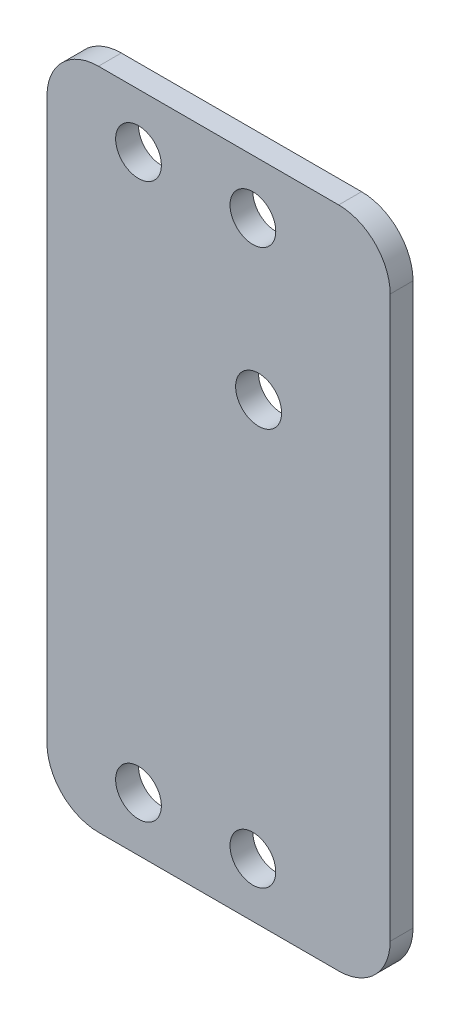
ISO-10303-21;
HEADER;
FILE_DESCRIPTION(('STEP AP214'),'2;1');
FILE_NAME('part.step','',(''),(''),'','','');
FILE_SCHEMA(('AUTOMOTIVE_DESIGN { 1 0 10303 214 1 1 1 1 }'));
ENDSEC;
DATA;
#1=APPLICATION_CONTEXT('core data for automotive mechanical design processes');
#2=APPLICATION_PROTOCOL_DEFINITION('international standard','automotive_design',2000,#1);
#3=PRODUCT_CONTEXT('',#1,'mechanical');
#4=PRODUCT('Part','Part','',(#3));
#5=PRODUCT_RELATED_PRODUCT_CATEGORY('part','',(#4));
#6=PRODUCT_DEFINITION_FORMATION('','',#4);
#7=PRODUCT_DEFINITION_CONTEXT('part definition',#1,'design');
#8=PRODUCT_DEFINITION('design','',#6,#7);
#9=PRODUCT_DEFINITION_SHAPE('','',#8);
#10=(LENGTH_UNIT() NAMED_UNIT(*) SI_UNIT(.MILLI.,.METRE.));
#11=(NAMED_UNIT(*) PLANE_ANGLE_UNIT() SI_UNIT($,.RADIAN.));
#12=(NAMED_UNIT(*) SI_UNIT($,.STERADIAN.) SOLID_ANGLE_UNIT());
#13=UNCERTAINTY_MEASURE_WITH_UNIT(LENGTH_MEASURE(1.E-05),#10,'distance_accuracy_value','');
#14=(GEOMETRIC_REPRESENTATION_CONTEXT(3) GLOBAL_UNCERTAINTY_ASSIGNED_CONTEXT((#13)) GLOBAL_UNIT_ASSIGNED_CONTEXT((#10,
#11,#12)) REPRESENTATION_CONTEXT('',''));
#15=CARTESIAN_POINT('',(0.,0.,0.));
#16=DIRECTION('',(0.,0.,1.));
#17=DIRECTION('',(1.,0.,0.));
#18=AXIS2_PLACEMENT_3D('',#15,#16,#17);
#19=CARTESIAN_POINT('',(0.,0.,2.));
#20=DIRECTION('',(0.,0.,1.));
#21=DIRECTION('',(1.,0.,0.));
#22=AXIS2_PLACEMENT_3D('',#19,#20,#21);
#23=PLANE('',#22);
#24=CARTESIAN_POINT('',(3.,-24.25,2.));
#25=DIRECTION('',(0.,0.,1.));
#26=DIRECTION('',(1.,0.,0.));
#27=AXIS2_PLACEMENT_3D('',#24,#25,#26);
#28=CIRCLE('',#27,2.);
#29=CARTESIAN_POINT('',(5.,-24.25,2.));
#30=VERTEX_POINT('',#29);
#31=EDGE_CURVE('E194',#30,#30,#28,.T.);
#32=ORIENTED_EDGE('',*,*,#31,.F.);
#33=EDGE_LOOP('',(#32));
#34=FACE_BOUND('',#33,.T.);
#35=CARTESIAN_POINT('',(-7.00000000000001,24.25,2.));
#36=DIRECTION('',(0.,0.,1.));
#37=DIRECTION('',(1.,0.,0.));
#38=AXIS2_PLACEMENT_3D('',#35,#36,#37);
#39=CIRCLE('',#38,2.);
#40=CARTESIAN_POINT('',(-5.00000000000001,24.25,2.));
#41=VERTEX_POINT('',#40);
#42=EDGE_CURVE('E183',#41,#41,#39,.T.);
#43=ORIENTED_EDGE('',*,*,#42,.F.);
#44=EDGE_LOOP('',(#43));
#45=FACE_BOUND('',#44,.T.);
#46=DIRECTION('',(1.,0.,0.));
#47=VECTOR('',#46,1.);
#48=CARTESIAN_POINT('',(-15.,-29.,2.));
#49=LINE('',#48,#47);
#50=CARTESIAN_POINT('',(-10.5,-29.,2.));
#51=VERTEX_POINT('',#50);
#52=CARTESIAN_POINT('',(10.5,-29.,2.));
#53=VERTEX_POINT('',#52);
#54=EDGE_CURVE('E168',#51,#53,#49,.T.);
#55=ORIENTED_EDGE('',*,*,#54,.T.);
#56=CARTESIAN_POINT('',(10.5,-24.5,2.));
#57=DIRECTION('',(0.,0.,1.));
#58=DIRECTION('',(1.,0.,0.));
#59=AXIS2_PLACEMENT_3D('',#56,#57,#58);
#60=CIRCLE('',#59,4.5);
#61=CARTESIAN_POINT('',(15.,-24.5,2.));
#62=VERTEX_POINT('',#61);
#63=EDGE_CURVE('E148',#53,#62,#60,.T.);
#64=ORIENTED_EDGE('',*,*,#63,.T.);
#65=DIRECTION('',(0.,1.,0.));
#66=VECTOR('',#65,1.);
#67=CARTESIAN_POINT('',(15.,29.,2.));
#68=LINE('',#67,#66);
#69=CARTESIAN_POINT('',(15.,24.5,2.));
#70=VERTEX_POINT('',#69);
#71=EDGE_CURVE('E118',#62,#70,#68,.T.);
#72=ORIENTED_EDGE('',*,*,#71,.T.);
#73=CARTESIAN_POINT('',(10.5,24.5,2.));
#74=DIRECTION('',(0.,0.,1.));
#75=DIRECTION('',(1.,0.,0.));
#76=AXIS2_PLACEMENT_3D('',#73,#74,#75);
#77=CIRCLE('',#76,4.5);
#78=CARTESIAN_POINT('',(10.5,29.,2.));
#79=VERTEX_POINT('',#78);
#80=EDGE_CURVE('E54',#70,#79,#77,.T.);
#81=ORIENTED_EDGE('',*,*,#80,.T.);
#82=DIRECTION('',(-1.,0.,0.));
#83=VECTOR('',#82,1.);
#84=CARTESIAN_POINT('',(-15.,29.,2.));
#85=LINE('',#84,#83);
#86=CARTESIAN_POINT('',(-10.5,29.,2.));
#87=VERTEX_POINT('',#86);
#88=EDGE_CURVE('E135',#79,#87,#85,.T.);
#89=ORIENTED_EDGE('',*,*,#88,.T.);
#90=CARTESIAN_POINT('',(-10.5,24.5,2.));
#91=DIRECTION('',(0.,0.,1.));
#92=DIRECTION('',(1.,0.,0.));
#93=AXIS2_PLACEMENT_3D('',#90,#91,#92);
#94=CIRCLE('',#93,4.5);
#95=CARTESIAN_POINT('',(-15.,24.5,2.));
#96=VERTEX_POINT('',#95);
#97=EDGE_CURVE('E143',#87,#96,#94,.T.);
#98=ORIENTED_EDGE('',*,*,#97,.T.);
#99=DIRECTION('',(0.,-1.,0.));
#100=VECTOR('',#99,1.);
#101=CARTESIAN_POINT('',(-15.,29.,2.));
#102=LINE('',#101,#100);
#103=CARTESIAN_POINT('',(-15.,-24.5,2.));
#104=VERTEX_POINT('',#103);
#105=EDGE_CURVE('E129',#96,#104,#102,.T.);
#106=ORIENTED_EDGE('',*,*,#105,.T.);
#107=CARTESIAN_POINT('',(-10.5,-24.5,2.));
#108=DIRECTION('',(0.,0.,1.));
#109=DIRECTION('',(1.,0.,0.));
#110=AXIS2_PLACEMENT_3D('',#107,#108,#109);
#111=CIRCLE('',#110,4.5);
#112=EDGE_CURVE('E146',#104,#51,#111,.T.);
#113=ORIENTED_EDGE('',*,*,#112,.T.);
#114=EDGE_LOOP('',(#55,#64,#72,#81,#89,#98,#106,#113));
#115=FACE_BOUND('',#114,.T.);
#116=CARTESIAN_POINT('',(2.99999999999999,24.25,2.));
#117=DIRECTION('',(0.,0.,1.));
#118=DIRECTION('',(1.,0.,0.));
#119=AXIS2_PLACEMENT_3D('',#116,#117,#118);
#120=CIRCLE('',#119,2.);
#121=CARTESIAN_POINT('',(4.99999999999999,24.25,2.));
#122=VERTEX_POINT('',#121);
#123=EDGE_CURVE('E174',#122,#122,#120,.T.);
#124=ORIENTED_EDGE('',*,*,#123,.F.);
#125=EDGE_LOOP('',(#124));
#126=FACE_BOUND('',#125,.T.);
#127=CARTESIAN_POINT('',(-7.,-24.25,2.));
#128=DIRECTION('',(0.,0.,1.));
#129=DIRECTION('',(1.,0.,0.));
#130=AXIS2_PLACEMENT_3D('',#127,#128,#129);
#131=CIRCLE('',#130,2.);
#132=CARTESIAN_POINT('',(-5.,-24.25,2.));
#133=VERTEX_POINT('',#132);
#134=EDGE_CURVE('E188',#133,#133,#131,.T.);
#135=ORIENTED_EDGE('',*,*,#134,.F.);
#136=EDGE_LOOP('',(#135));
#137=FACE_BOUND('',#136,.T.);
#138=CARTESIAN_POINT('',(3.5,10.75,2.));
#139=DIRECTION('',(0.,0.,1.));
#140=DIRECTION('',(1.,0.,0.));
#141=AXIS2_PLACEMENT_3D('',#138,#139,#140);
#142=CIRCLE('',#141,2.01);
#143=CARTESIAN_POINT('',(5.51,10.75,2.));
#144=VERTEX_POINT('',#143);
#145=EDGE_CURVE('E200',#144,#144,#142,.T.);
#146=ORIENTED_EDGE('',*,*,#145,.F.);
#147=EDGE_LOOP('',(#146));
#148=FACE_BOUND('',#147,.T.);
#149=ADVANCED_FACE('F33',(#34,#45,#115,#126,#137,#148),#23,.T.);
#150=CARTESIAN_POINT('',(0.,0.,0.));
#151=DIRECTION('',(0.,0.,1.));
#152=DIRECTION('',(1.,0.,0.));
#153=AXIS2_PLACEMENT_3D('',#150,#151,#152);
#154=PLANE('',#153);
#155=DIRECTION('',(0.,1.,0.));
#156=VECTOR('',#155,1.);
#157=CARTESIAN_POINT('',(15.,29.,0.));
#158=LINE('',#157,#156);
#159=CARTESIAN_POINT('',(15.,-24.5,0.));
#160=VERTEX_POINT('',#159);
#161=CARTESIAN_POINT('',(15.,24.5,0.));
#162=VERTEX_POINT('',#161);
#163=EDGE_CURVE('E116',#160,#162,#158,.T.);
#164=ORIENTED_EDGE('',*,*,#163,.F.);
#165=CARTESIAN_POINT('',(10.5,-24.5,0.));
#166=DIRECTION('',(0.,0.,1.));
#167=DIRECTION('',(1.,0.,0.));
#168=AXIS2_PLACEMENT_3D('',#165,#166,#167);
#169=CIRCLE('',#168,4.5);
#170=CARTESIAN_POINT('',(10.5,-29.,0.));
#171=VERTEX_POINT('',#170);
#172=EDGE_CURVE('E99',#160,#171,#169,.F.);
#173=ORIENTED_EDGE('',*,*,#172,.T.);
#174=DIRECTION('',(1.,0.,0.));
#175=VECTOR('',#174,1.);
#176=CARTESIAN_POINT('',(-15.,-29.,0.));
#177=LINE('',#176,#175);
#178=CARTESIAN_POINT('',(-10.5,-29.,0.));
#179=VERTEX_POINT('',#178);
#180=EDGE_CURVE('E127',#179,#171,#177,.T.);
#181=ORIENTED_EDGE('',*,*,#180,.F.);
#182=CARTESIAN_POINT('',(-10.5,-24.5,0.));
#183=DIRECTION('',(0.,0.,1.));
#184=DIRECTION('',(1.,0.,0.));
#185=AXIS2_PLACEMENT_3D('',#182,#183,#184);
#186=CIRCLE('',#185,4.5);
#187=CARTESIAN_POINT('',(-15.,-24.5,0.));
#188=VERTEX_POINT('',#187);
#189=EDGE_CURVE('E110',#179,#188,#186,.F.);
#190=ORIENTED_EDGE('',*,*,#189,.T.);
#191=DIRECTION('',(0.,-1.,0.));
#192=VECTOR('',#191,1.);
#193=CARTESIAN_POINT('',(-15.,29.,0.));
#194=LINE('',#193,#192);
#195=CARTESIAN_POINT('',(-15.,24.5,0.));
#196=VERTEX_POINT('',#195);
#197=EDGE_CURVE('E131',#196,#188,#194,.T.);
#198=ORIENTED_EDGE('',*,*,#197,.F.);
#199=CARTESIAN_POINT('',(-10.5,24.5,0.));
#200=DIRECTION('',(0.,0.,1.));
#201=DIRECTION('',(1.,0.,0.));
#202=AXIS2_PLACEMENT_3D('',#199,#200,#201);
#203=CIRCLE('',#202,4.5);
#204=CARTESIAN_POINT('',(-10.5,29.,0.));
#205=VERTEX_POINT('',#204);
#206=EDGE_CURVE('E119',#196,#205,#203,.F.);
#207=ORIENTED_EDGE('',*,*,#206,.T.);
#208=DIRECTION('',(-1.,0.,0.));
#209=VECTOR('',#208,1.);
#210=CARTESIAN_POINT('',(-15.,29.,0.));
#211=LINE('',#210,#209);
#212=CARTESIAN_POINT('',(10.5,29.,0.));
#213=VERTEX_POINT('',#212);
#214=EDGE_CURVE('E126',#213,#205,#211,.T.);
#215=ORIENTED_EDGE('',*,*,#214,.F.);
#216=CARTESIAN_POINT('',(10.5,24.5,0.));
#217=DIRECTION('',(0.,0.,1.));
#218=DIRECTION('',(1.,0.,0.));
#219=AXIS2_PLACEMENT_3D('',#216,#217,#218);
#220=CIRCLE('',#219,4.5);
#221=EDGE_CURVE('E125',#213,#162,#220,.F.);
#222=ORIENTED_EDGE('',*,*,#221,.T.);
#223=EDGE_LOOP('',(#164,#173,#181,#190,#198,#207,#215,#222));
#224=FACE_BOUND('',#223,.T.);
#225=CARTESIAN_POINT('',(2.99999999999999,24.25,0.));
#226=DIRECTION('',(0.,0.,1.));
#227=DIRECTION('',(1.,0.,0.));
#228=AXIS2_PLACEMENT_3D('',#225,#226,#227);
#229=CIRCLE('',#228,2.);
#230=CARTESIAN_POINT('',(4.99999999999999,24.25,0.));
#231=VERTEX_POINT('',#230);
#232=EDGE_CURVE('E176',#231,#231,#229,.T.);
#233=ORIENTED_EDGE('',*,*,#232,.T.);
#234=EDGE_LOOP('',(#233));
#235=FACE_BOUND('',#234,.T.);
#236=CARTESIAN_POINT('',(-7.00000000000001,24.25,0.));
#237=DIRECTION('',(0.,0.,1.));
#238=DIRECTION('',(1.,0.,0.));
#239=AXIS2_PLACEMENT_3D('',#236,#237,#238);
#240=CIRCLE('',#239,2.);
#241=CARTESIAN_POINT('',(-5.00000000000001,24.25,0.));
#242=VERTEX_POINT('',#241);
#243=EDGE_CURVE('E185',#242,#242,#240,.T.);
#244=ORIENTED_EDGE('',*,*,#243,.T.);
#245=EDGE_LOOP('',(#244));
#246=FACE_BOUND('',#245,.T.);
#247=CARTESIAN_POINT('',(-7.,-24.25,0.));
#248=DIRECTION('',(0.,0.,1.));
#249=DIRECTION('',(1.,0.,0.));
#250=AXIS2_PLACEMENT_3D('',#247,#248,#249);
#251=CIRCLE('',#250,2.);
#252=CARTESIAN_POINT('',(-5.,-24.25,0.));
#253=VERTEX_POINT('',#252);
#254=EDGE_CURVE('E191',#253,#253,#251,.T.);
#255=ORIENTED_EDGE('',*,*,#254,.T.);
#256=EDGE_LOOP('',(#255));
#257=FACE_BOUND('',#256,.T.);
#258=CARTESIAN_POINT('',(3.,-24.25,0.));
#259=DIRECTION('',(0.,0.,1.));
#260=DIRECTION('',(1.,0.,0.));
#261=AXIS2_PLACEMENT_3D('',#258,#259,#260);
#262=CIRCLE('',#261,2.);
#263=CARTESIAN_POINT('',(5.,-24.25,0.));
#264=VERTEX_POINT('',#263);
#265=EDGE_CURVE('E197',#264,#264,#262,.T.);
#266=ORIENTED_EDGE('',*,*,#265,.T.);
#267=EDGE_LOOP('',(#266));
#268=FACE_BOUND('',#267,.T.);
#269=CARTESIAN_POINT('',(3.5,10.75,0.));
#270=DIRECTION('',(0.,0.,1.));
#271=DIRECTION('',(1.,0.,0.));
#272=AXIS2_PLACEMENT_3D('',#269,#270,#271);
#273=CIRCLE('',#272,2.01);
#274=CARTESIAN_POINT('',(5.51,10.75,0.));
#275=VERTEX_POINT('',#274);
#276=EDGE_CURVE('E203',#275,#275,#273,.T.);
#277=ORIENTED_EDGE('',*,*,#276,.T.);
#278=EDGE_LOOP('',(#277));
#279=FACE_BOUND('',#278,.T.);
#280=ADVANCED_FACE('F122',(#224,#235,#246,#257,#268,#279),#154,.F.);
#281=CARTESIAN_POINT('',(-15.,29.,2.));
#282=DIRECTION('',(1.,0.,0.));
#283=DIRECTION('',(0.,0.,-1.));
#284=AXIS2_PLACEMENT_3D('',#281,#282,#283);
#285=PLANE('',#284);
#286=ORIENTED_EDGE('',*,*,#197,.T.);
#287=DIRECTION('',(0.,0.,-1.));
#288=VECTOR('',#287,1.);
#289=CARTESIAN_POINT('',(-15.,-24.5,2.));
#290=LINE('',#289,#288);
#291=EDGE_CURVE('E153',#188,#104,#290,.F.);
#292=ORIENTED_EDGE('',*,*,#291,.T.);
#293=ORIENTED_EDGE('',*,*,#105,.F.);
#294=DIRECTION('',(0.,0.,-1.));
#295=VECTOR('',#294,1.);
#296=CARTESIAN_POINT('',(-15.,24.5,2.));
#297=LINE('',#296,#295);
#298=EDGE_CURVE('E150',#96,#196,#297,.T.);
#299=ORIENTED_EDGE('',*,*,#298,.T.);
#300=EDGE_LOOP('',(#286,#292,#293,#299));
#301=FACE_BOUND('',#300,.T.);
#302=ADVANCED_FACE('F159',(#301),#285,.F.);
#303=CARTESIAN_POINT('',(-15.,-29.,2.));
#304=DIRECTION('',(0.,1.,0.));
#305=DIRECTION('',(0.,0.,1.));
#306=AXIS2_PLACEMENT_3D('',#303,#304,#305);
#307=PLANE('',#306);
#308=ORIENTED_EDGE('',*,*,#180,.T.);
#309=DIRECTION('',(0.,0.,-1.));
#310=VECTOR('',#309,1.);
#311=CARTESIAN_POINT('',(10.5,-29.,2.));
#312=LINE('',#311,#310);
#313=EDGE_CURVE('E104',#171,#53,#312,.F.);
#314=ORIENTED_EDGE('',*,*,#313,.T.);
#315=ORIENTED_EDGE('',*,*,#54,.F.);
#316=DIRECTION('',(0.,0.,-1.));
#317=VECTOR('',#316,1.);
#318=CARTESIAN_POINT('',(-10.5,-29.,2.));
#319=LINE('',#318,#317);
#320=EDGE_CURVE('E109',#51,#179,#319,.T.);
#321=ORIENTED_EDGE('',*,*,#320,.T.);
#322=EDGE_LOOP('',(#308,#314,#315,#321));
#323=FACE_BOUND('',#322,.T.);
#324=ADVANCED_FACE('F173',(#323),#307,.F.);
#325=CARTESIAN_POINT('',(15.,29.,2.));
#326=DIRECTION('',(-1.,0.,0.));
#327=DIRECTION('',(0.,0.,1.));
#328=AXIS2_PLACEMENT_3D('',#325,#326,#327);
#329=PLANE('',#328);
#330=ORIENTED_EDGE('',*,*,#71,.F.);
#331=DIRECTION('',(0.,0.,-1.));
#332=VECTOR('',#331,1.);
#333=CARTESIAN_POINT('',(15.,-24.5,2.));
#334=LINE('',#333,#332);
#335=EDGE_CURVE('E103',#62,#160,#334,.T.);
#336=ORIENTED_EDGE('',*,*,#335,.T.);
#337=ORIENTED_EDGE('',*,*,#163,.T.);
#338=DIRECTION('',(0.,0.,-1.));
#339=VECTOR('',#338,1.);
#340=CARTESIAN_POINT('',(15.,24.5,2.));
#341=LINE('',#340,#339);
#342=EDGE_CURVE('E120',#162,#70,#341,.F.);
#343=ORIENTED_EDGE('',*,*,#342,.T.);
#344=EDGE_LOOP('',(#330,#336,#337,#343));
#345=FACE_BOUND('',#344,.T.);
#346=ADVANCED_FACE('F115',(#345),#329,.F.);
#347=CARTESIAN_POINT('',(-15.,29.,2.));
#348=DIRECTION('',(0.,-1.,0.));
#349=DIRECTION('',(0.,0.,-1.));
#350=AXIS2_PLACEMENT_3D('',#347,#348,#349);
#351=PLANE('',#350);
#352=ORIENTED_EDGE('',*,*,#88,.F.);
#353=DIRECTION('',(0.,0.,-1.));
#354=VECTOR('',#353,1.);
#355=CARTESIAN_POINT('',(10.5,29.,2.));
#356=LINE('',#355,#354);
#357=EDGE_CURVE('E11',#79,#213,#356,.T.);
#358=ORIENTED_EDGE('',*,*,#357,.T.);
#359=ORIENTED_EDGE('',*,*,#214,.T.);
#360=DIRECTION('',(0.,0.,-1.));
#361=VECTOR('',#360,1.);
#362=CARTESIAN_POINT('',(-10.5,29.,2.));
#363=LINE('',#362,#361);
#364=EDGE_CURVE('E41',#205,#87,#363,.F.);
#365=ORIENTED_EDGE('',*,*,#364,.T.);
#366=EDGE_LOOP('',(#352,#358,#359,#365));
#367=FACE_BOUND('',#366,.T.);
#368=ADVANCED_FACE('F225',(#367),#351,.F.);
#369=CARTESIAN_POINT('',(2.99999999999999,24.25,2.));
#370=DIRECTION('',(0.,0.,-1.));
#371=DIRECTION('',(-1.,0.,0.));
#372=AXIS2_PLACEMENT_3D('',#369,#370,#371);
#373=CYLINDRICAL_SURFACE('',#372,2.);
#374=ORIENTED_EDGE('',*,*,#123,.T.);
#375=EDGE_LOOP('',(#374));
#376=FACE_BOUND('',#375,.T.);
#377=ORIENTED_EDGE('',*,*,#232,.F.);
#378=EDGE_LOOP('',(#377));
#379=FACE_BOUND('',#378,.T.);
#380=ADVANCED_FACE('F222',(#376,#379),#373,.F.);
#381=CARTESIAN_POINT('',(-7.00000000000001,24.25,2.));
#382=DIRECTION('',(0.,0.,-1.));
#383=DIRECTION('',(-1.,0.,0.));
#384=AXIS2_PLACEMENT_3D('',#381,#382,#383);
#385=CYLINDRICAL_SURFACE('',#384,2.);
#386=ORIENTED_EDGE('',*,*,#42,.T.);
#387=EDGE_LOOP('',(#386));
#388=FACE_BOUND('',#387,.T.);
#389=ORIENTED_EDGE('',*,*,#243,.F.);
#390=EDGE_LOOP('',(#389));
#391=FACE_BOUND('',#390,.T.);
#392=ADVANCED_FACE('F327',(#388,#391),#385,.F.);
#393=CARTESIAN_POINT('',(-7.,-24.25,2.));
#394=DIRECTION('',(0.,0.,-1.));
#395=DIRECTION('',(-1.,0.,0.));
#396=AXIS2_PLACEMENT_3D('',#393,#394,#395);
#397=CYLINDRICAL_SURFACE('',#396,2.);
#398=ORIENTED_EDGE('',*,*,#134,.T.);
#399=EDGE_LOOP('',(#398));
#400=FACE_BOUND('',#399,.T.);
#401=ORIENTED_EDGE('',*,*,#254,.F.);
#402=EDGE_LOOP('',(#401));
#403=FACE_BOUND('',#402,.T.);
#404=ADVANCED_FACE('F317',(#400,#403),#397,.F.);
#405=CARTESIAN_POINT('',(3.,-24.25,2.));
#406=DIRECTION('',(0.,0.,-1.));
#407=DIRECTION('',(-1.,0.,0.));
#408=AXIS2_PLACEMENT_3D('',#405,#406,#407);
#409=CYLINDRICAL_SURFACE('',#408,2.);
#410=ORIENTED_EDGE('',*,*,#31,.T.);
#411=EDGE_LOOP('',(#410));
#412=FACE_BOUND('',#411,.T.);
#413=ORIENTED_EDGE('',*,*,#265,.F.);
#414=EDGE_LOOP('',(#413));
#415=FACE_BOUND('',#414,.T.);
#416=ADVANCED_FACE('F308',(#412,#415),#409,.F.);
#417=CARTESIAN_POINT('',(3.5,10.75,2.));
#418=DIRECTION('',(0.,0.,-1.));
#419=DIRECTION('',(-1.,0.,0.));
#420=AXIS2_PLACEMENT_3D('',#417,#418,#419);
#421=CYLINDRICAL_SURFACE('',#420,2.01);
#422=ORIENTED_EDGE('',*,*,#145,.T.);
#423=EDGE_LOOP('',(#422));
#424=FACE_BOUND('',#423,.T.);
#425=ORIENTED_EDGE('',*,*,#276,.F.);
#426=EDGE_LOOP('',(#425));
#427=FACE_BOUND('',#426,.T.);
#428=ADVANCED_FACE('F209',(#424,#427),#421,.F.);
#429=CARTESIAN_POINT('',(10.5,-24.5,2.));
#430=DIRECTION('',(0.,0.,-1.));
#431=DIRECTION('',(-1.,0.,0.));
#432=AXIS2_PLACEMENT_3D('',#429,#430,#431);
#433=CYLINDRICAL_SURFACE('',#432,4.5);
#434=ORIENTED_EDGE('',*,*,#63,.F.);
#435=ORIENTED_EDGE('',*,*,#313,.F.);
#436=ORIENTED_EDGE('',*,*,#172,.F.);
#437=ORIENTED_EDGE('',*,*,#335,.F.);
#438=EDGE_LOOP('',(#434,#435,#436,#437));
#439=FACE_BOUND('',#438,.T.);
#440=ADVANCED_FACE('F102',(#439),#433,.T.);
#441=CARTESIAN_POINT('',(-10.5,-24.5,2.));
#442=DIRECTION('',(0.,0.,-1.));
#443=DIRECTION('',(-1.,0.,0.));
#444=AXIS2_PLACEMENT_3D('',#441,#442,#443);
#445=CYLINDRICAL_SURFACE('',#444,4.5);
#446=ORIENTED_EDGE('',*,*,#112,.F.);
#447=ORIENTED_EDGE('',*,*,#291,.F.);
#448=ORIENTED_EDGE('',*,*,#189,.F.);
#449=ORIENTED_EDGE('',*,*,#320,.F.);
#450=EDGE_LOOP('',(#446,#447,#448,#449));
#451=FACE_BOUND('',#450,.T.);
#452=ADVANCED_FACE('F171',(#451),#445,.T.);
#453=CARTESIAN_POINT('',(10.5,24.5,2.));
#454=DIRECTION('',(0.,0.,-1.));
#455=DIRECTION('',(-1.,0.,0.));
#456=AXIS2_PLACEMENT_3D('',#453,#454,#455);
#457=CYLINDRICAL_SURFACE('',#456,4.5);
#458=ORIENTED_EDGE('',*,*,#80,.F.);
#459=ORIENTED_EDGE('',*,*,#342,.F.);
#460=ORIENTED_EDGE('',*,*,#221,.F.);
#461=ORIENTED_EDGE('',*,*,#357,.F.);
#462=EDGE_LOOP('',(#458,#459,#460,#461));
#463=FACE_BOUND('',#462,.T.);
#464=ADVANCED_FACE('F237',(#463),#457,.T.);
#465=CARTESIAN_POINT('',(-10.5,24.5,2.));
#466=DIRECTION('',(0.,0.,-1.));
#467=DIRECTION('',(-1.,0.,0.));
#468=AXIS2_PLACEMENT_3D('',#465,#466,#467);
#469=CYLINDRICAL_SURFACE('',#468,4.5);
#470=ORIENTED_EDGE('',*,*,#97,.F.);
#471=ORIENTED_EDGE('',*,*,#364,.F.);
#472=ORIENTED_EDGE('',*,*,#206,.F.);
#473=ORIENTED_EDGE('',*,*,#298,.F.);
#474=EDGE_LOOP('',(#470,#471,#472,#473));
#475=FACE_BOUND('',#474,.T.);
#476=ADVANCED_FACE('F35',(#475),#469,.T.);
#477=CLOSED_SHELL('',(#149,#280,#302,#324,#346,#368,#380,#392,#404,#416,#428,#440,#452,#464,#476));
#478=MANIFOLD_SOLID_BREP('B2',#477);
#479=ADVANCED_BREP_SHAPE_REPRESENTATION('',(#18,#478),#14);
#480=SHAPE_DEFINITION_REPRESENTATION(#9,#479);
ENDSEC;
END-ISO-10303-21;
